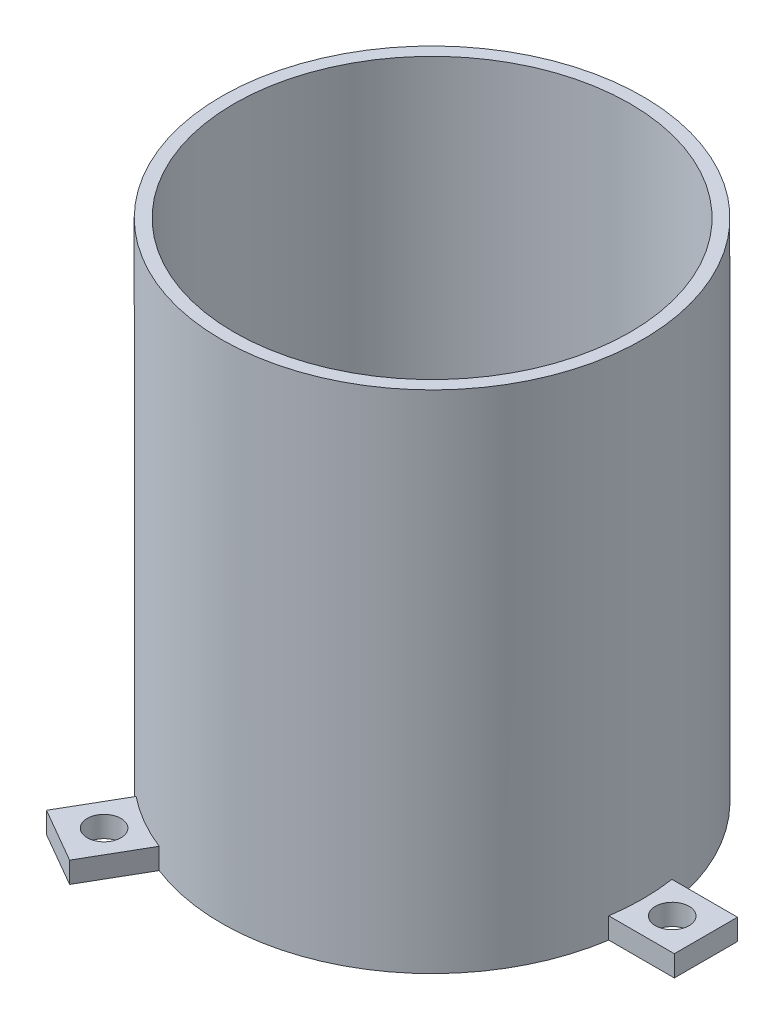
ISO-10303-21;
HEADER;
FILE_DESCRIPTION(('STEP AP214'),'2;1');
FILE_NAME('part.step','',(''),(''),'','','');
FILE_SCHEMA(('AUTOMOTIVE_DESIGN { 1 0 10303 214 1 1 1 1 }'));
ENDSEC;
DATA;
#1=APPLICATION_CONTEXT('core data for automotive mechanical design processes');
#2=APPLICATION_PROTOCOL_DEFINITION('international standard','automotive_design',2000,#1);
#3=PRODUCT_CONTEXT('',#1,'mechanical');
#4=PRODUCT('Part','Part','',(#3));
#5=PRODUCT_RELATED_PRODUCT_CATEGORY('part','',(#4));
#6=PRODUCT_DEFINITION_FORMATION('','',#4);
#7=PRODUCT_DEFINITION_CONTEXT('part definition',#1,'design');
#8=PRODUCT_DEFINITION('design','',#6,#7);
#9=PRODUCT_DEFINITION_SHAPE('','',#8);
#10=(LENGTH_UNIT() NAMED_UNIT(*) SI_UNIT(.MILLI.,.METRE.));
#11=(NAMED_UNIT(*) PLANE_ANGLE_UNIT() SI_UNIT($,.RADIAN.));
#12=(NAMED_UNIT(*) SI_UNIT($,.STERADIAN.) SOLID_ANGLE_UNIT());
#13=UNCERTAINTY_MEASURE_WITH_UNIT(LENGTH_MEASURE(1.E-05),#10,'distance_accuracy_value','');
#14=(GEOMETRIC_REPRESENTATION_CONTEXT(3) GLOBAL_UNCERTAINTY_ASSIGNED_CONTEXT((#13)) GLOBAL_UNIT_ASSIGNED_CONTEXT((#10,
#11,#12)) REPRESENTATION_CONTEXT('',''));
#15=CARTESIAN_POINT('',(0.,0.,0.));
#16=DIRECTION('',(0.,0.,1.));
#17=DIRECTION('',(1.,0.,0.));
#18=AXIS2_PLACEMENT_3D('',#15,#16,#17);
#19=CARTESIAN_POINT('',(0.,120.,0.));
#20=DIRECTION('',(0.,-1.,0.));
#21=DIRECTION('',(0.,0.,-1.));
#22=AXIS2_PLACEMENT_3D('',#19,#20,#21);
#23=CYLINDRICAL_SURFACE('',#22,50.);
#24=CARTESIAN_POINT('',(0.,0.,0.));
#25=DIRECTION('',(0.,1.,0.));
#26=DIRECTION('',(0.,0.,1.));
#27=AXIS2_PLACEMENT_3D('',#24,#25,#26);
#28=CIRCLE('',#27,50.);
#29=CARTESIAN_POINT('',(-31.21234044499,0.,-39.0613594738591));
#30=VERTEX_POINT('',#29);
#31=CARTESIAN_POINT('',(-31.2123404449894,0.,39.0613594738596));
#32=VERTEX_POINT('',#31);
#33=EDGE_CURVE('E36',#30,#32,#28,.T.);
#34=ORIENTED_EDGE('',*,*,#33,.T.);
#35=DIRECTION('',(0.,-1.,0.));
#36=VECTOR('',#35,1.);
#37=CARTESIAN_POINT('',(-31.2123404449894,5.,39.0613594738596));
#38=LINE('',#37,#36);
#39=CARTESIAN_POINT('',(-31.2123404449894,5.,39.0613594738596));
#40=VERTEX_POINT('',#39);
#41=EDGE_CURVE('E47',#40,#32,#38,.T.);
#42=ORIENTED_EDGE('',*,*,#41,.F.);
#43=CARTESIAN_POINT('',(0.,5.,0.));
#44=DIRECTION('',(0.,1.,0.));
#45=DIRECTION('',(0.,0.,-1.));
#46=AXIS2_PLACEMENT_3D('',#43,#44,#45);
#47=CIRCLE('',#46,50.);
#48=CARTESIAN_POINT('',(-18.2219593882228,5.,46.5613594738594));
#49=VERTEX_POINT('',#48);
#50=EDGE_CURVE('E51',#40,#49,#47,.T.);
#51=ORIENTED_EDGE('',*,*,#50,.T.);
#52=DIRECTION('',(0.,-1.,0.));
#53=VECTOR('',#52,1.);
#54=CARTESIAN_POINT('',(-18.2219593882228,5.,46.5613594738594));
#55=LINE('',#54,#53);
#56=CARTESIAN_POINT('',(-18.2219593882228,0.,46.5613594738594));
#57=VERTEX_POINT('',#56);
#58=EDGE_CURVE('E132',#49,#57,#55,.T.);
#59=ORIENTED_EDGE('',*,*,#58,.T.);
#60=CARTESIAN_POINT('',(49.434299833213,0.,7.5));
#61=VERTEX_POINT('',#60);
#62=EDGE_CURVE('E237',#57,#61,#28,.T.);
#63=ORIENTED_EDGE('',*,*,#62,.T.);
#64=DIRECTION('',(0.,-1.,0.));
#65=VECTOR('',#64,1.);
#66=CARTESIAN_POINT('',(49.434299833213,5.,7.5));
#67=LINE('',#66,#65);
#68=CARTESIAN_POINT('',(49.434299833213,5.,7.5));
#69=VERTEX_POINT('',#68);
#70=EDGE_CURVE('E184',#69,#61,#67,.T.);
#71=ORIENTED_EDGE('',*,*,#70,.F.);
#72=CARTESIAN_POINT('',(0.,5.,0.));
#73=DIRECTION('',(0.,1.,0.));
#74=DIRECTION('',(0.,0.,-1.));
#75=AXIS2_PLACEMENT_3D('',#72,#73,#74);
#76=CIRCLE('',#75,50.);
#77=CARTESIAN_POINT('',(49.434299833213,5.,-7.5));
#78=VERTEX_POINT('',#77);
#79=EDGE_CURVE('E164',#69,#78,#76,.T.);
#80=ORIENTED_EDGE('',*,*,#79,.T.);
#81=DIRECTION('',(0.,-1.,0.));
#82=VECTOR('',#81,1.);
#83=CARTESIAN_POINT('',(49.434299833213,5.,-7.5));
#84=LINE('',#83,#82);
#85=CARTESIAN_POINT('',(49.434299833213,0.,-7.5));
#86=VERTEX_POINT('',#85);
#87=EDGE_CURVE('E176',#78,#86,#84,.T.);
#88=ORIENTED_EDGE('',*,*,#87,.T.);
#89=CARTESIAN_POINT('',(-18.2219593882234,0.,-46.5613594738592));
#90=VERTEX_POINT('',#89);
#91=EDGE_CURVE('E234',#86,#90,#28,.T.);
#92=ORIENTED_EDGE('',*,*,#91,.T.);
#93=DIRECTION('',(0.,-1.,0.));
#94=VECTOR('',#93,1.);
#95=CARTESIAN_POINT('',(-18.2219593882234,5.,-46.5613594738592));
#96=LINE('',#95,#94);
#97=CARTESIAN_POINT('',(-18.2219593882234,5.,-46.5613594738592));
#98=VERTEX_POINT('',#97);
#99=EDGE_CURVE('E220',#98,#90,#96,.T.);
#100=ORIENTED_EDGE('',*,*,#99,.F.);
#101=CARTESIAN_POINT('',(0.,5.,0.));
#102=DIRECTION('',(0.,1.,0.));
#103=DIRECTION('',(0.,0.,-1.));
#104=AXIS2_PLACEMENT_3D('',#101,#102,#103);
#105=CIRCLE('',#104,50.);
#106=CARTESIAN_POINT('',(-31.21234044499,5.,-39.0613594738591));
#107=VERTEX_POINT('',#106);
#108=EDGE_CURVE('E200',#98,#107,#105,.T.);
#109=ORIENTED_EDGE('',*,*,#108,.T.);
#110=DIRECTION('',(0.,-1.,0.));
#111=VECTOR('',#110,1.);
#112=CARTESIAN_POINT('',(-31.21234044499,5.,-39.0613594738591));
#113=LINE('',#112,#111);
#114=EDGE_CURVE('E212',#107,#30,#113,.T.);
#115=ORIENTED_EDGE('',*,*,#114,.T.);
#116=EDGE_LOOP('',(#34,#42,#51,#59,#63,#71,#80,#88,#92,#100,#109,#115));
#117=FACE_BOUND('',#116,.T.);
#118=CARTESIAN_POINT('',(0.,120.,0.));
#119=DIRECTION('',(0.,1.,0.));
#120=DIRECTION('',(0.,0.,1.));
#121=AXIS2_PLACEMENT_3D('',#118,#119,#120);
#122=CIRCLE('',#121,50.);
#123=CARTESIAN_POINT('',(0.,120.,50.));
#124=VERTEX_POINT('',#123);
#125=EDGE_CURVE('E11',#124,#124,#122,.T.);
#126=ORIENTED_EDGE('',*,*,#125,.F.);
#127=EDGE_LOOP('',(#126));
#128=FACE_BOUND('',#127,.T.);
#129=ADVANCED_FACE('F33',(#117,#128),#23,.T.);
#130=CARTESIAN_POINT('',(0.,120.,0.));
#131=DIRECTION('',(0.,1.,0.));
#132=DIRECTION('',(0.,0.,1.));
#133=AXIS2_PLACEMENT_3D('',#130,#131,#132);
#134=PLANE('',#133);
#135=CARTESIAN_POINT('',(0.,120.,0.));
#136=DIRECTION('',(0.,1.,0.));
#137=DIRECTION('',(0.,0.,1.));
#138=AXIS2_PLACEMENT_3D('',#135,#136,#137);
#139=CIRCLE('',#138,47.);
#140=CARTESIAN_POINT('',(0.,120.,47.));
#141=VERTEX_POINT('',#140);
#142=EDGE_CURVE('E232',#141,#141,#139,.T.);
#143=ORIENTED_EDGE('',*,*,#142,.F.);
#144=EDGE_LOOP('',(#143));
#145=FACE_BOUND('',#144,.T.);
#146=ORIENTED_EDGE('',*,*,#125,.T.);
#147=EDGE_LOOP('',(#146));
#148=FACE_BOUND('',#147,.T.);
#149=ADVANCED_FACE('F285',(#145,#148),#134,.T.);
#150=CARTESIAN_POINT('',(0.,0.,0.));
#151=DIRECTION('',(0.,1.,0.));
#152=DIRECTION('',(0.,0.,1.));
#153=AXIS2_PLACEMENT_3D('',#150,#151,#152);
#154=PLANE('',#153);
#155=ORIENTED_EDGE('',*,*,#33,.F.);
#156=DIRECTION('',(-0.500000000000004,0.,-0.866025403784437));
#157=VECTOR('',#156,1.);
#158=CARTESIAN_POINT('',(-38.9951905283835,0.,-52.5416512459883));
#159=LINE('',#158,#157);
#160=CARTESIAN_POINT('',(-38.9951905283835,0.,-52.5416512459883));
#161=VERTEX_POINT('',#160);
#162=EDGE_CURVE('E197',#30,#161,#159,.T.);
#163=ORIENTED_EDGE('',*,*,#162,.T.);
#164=DIRECTION('',(0.866025403784436,0.,-0.500000000000004));
#165=VECTOR('',#164,1.);
#166=CARTESIAN_POINT('',(-26.004809471617,0.,-60.0416512459884));
#167=LINE('',#166,#165);
#168=CARTESIAN_POINT('',(-26.004809471617,0.,-60.0416512459884));
#169=VERTEX_POINT('',#168);
#170=EDGE_CURVE('E215',#161,#169,#167,.T.);
#171=ORIENTED_EDGE('',*,*,#170,.T.);
#172=DIRECTION('',(0.500000000000004,0.,0.866025403784436));
#173=VECTOR('',#172,1.);
#174=CARTESIAN_POINT('',(-18.2219593882234,0.,-46.5613594738592));
#175=LINE('',#174,#173);
#176=EDGE_CURVE('E203',#169,#90,#175,.T.);
#177=ORIENTED_EDGE('',*,*,#176,.T.);
#178=ORIENTED_EDGE('',*,*,#91,.F.);
#179=DIRECTION('',(1.,0.,0.));
#180=VECTOR('',#179,1.);
#181=CARTESIAN_POINT('',(65.,0.,-7.5));
#182=LINE('',#181,#180);
#183=CARTESIAN_POINT('',(65.,0.,-7.5));
#184=VERTEX_POINT('',#183);
#185=EDGE_CURVE('E161',#86,#184,#182,.T.);
#186=ORIENTED_EDGE('',*,*,#185,.T.);
#187=DIRECTION('',(0.,0.,1.));
#188=VECTOR('',#187,1.);
#189=CARTESIAN_POINT('',(65.,0.,7.5));
#190=LINE('',#189,#188);
#191=CARTESIAN_POINT('',(65.,0.,7.5));
#192=VERTEX_POINT('',#191);
#193=EDGE_CURVE('E179',#184,#192,#190,.T.);
#194=ORIENTED_EDGE('',*,*,#193,.T.);
#195=DIRECTION('',(-1.,0.,0.));
#196=VECTOR('',#195,1.);
#197=CARTESIAN_POINT('',(49.434299833213,0.,7.5));
#198=LINE('',#197,#196);
#199=EDGE_CURVE('E167',#192,#61,#198,.T.);
#200=ORIENTED_EDGE('',*,*,#199,.T.);
#201=ORIENTED_EDGE('',*,*,#62,.F.);
#202=DIRECTION('',(-0.499999999999992,0.,0.866025403784443));
#203=VECTOR('',#202,1.);
#204=CARTESIAN_POINT('',(-26.0048094716162,0.,60.0416512459888));
#205=LINE('',#204,#203);
#206=CARTESIAN_POINT('',(-26.0048094716162,0.,60.0416512459888));
#207=VERTEX_POINT('',#206);
#208=EDGE_CURVE('E148',#57,#207,#205,.T.);
#209=ORIENTED_EDGE('',*,*,#208,.T.);
#210=DIRECTION('',(-0.866025403784443,0.,-0.499999999999992));
#211=VECTOR('',#210,1.);
#212=CARTESIAN_POINT('',(-38.9951905283828,0.,52.5416512459889));
#213=LINE('',#212,#211);
#214=CARTESIAN_POINT('',(-38.9951905283828,0.,52.5416512459889));
#215=VERTEX_POINT('',#214);
#216=EDGE_CURVE('E126',#207,#215,#213,.T.);
#217=ORIENTED_EDGE('',*,*,#216,.T.);
#218=DIRECTION('',(0.499999999999992,0.,-0.866025403784443));
#219=VECTOR('',#218,1.);
#220=CARTESIAN_POINT('',(-31.2123404449894,0.,39.0613594738596));
#221=LINE('',#220,#219);
#222=EDGE_CURVE('E143',#215,#32,#221,.T.);
#223=ORIENTED_EDGE('',*,*,#222,.T.);
#224=EDGE_LOOP('',(#155,#163,#171,#177,#178,#186,#194,#200,#201,#209,#217,#223));
#225=FACE_BOUND('',#224,.T.);
#226=CARTESIAN_POINT('',(-28.5000000000002,0.,-49.3634480157129));
#227=DIRECTION('',(0.,-1.,0.));
#228=DIRECTION('',(0.,0.,-1.));
#229=AXIS2_PLACEMENT_3D('',#226,#227,#228);
#230=CIRCLE('',#229,4.);
#231=CARTESIAN_POINT('',(-28.5000000000002,0.,-53.3634480157129));
#232=VERTEX_POINT('',#231);
#233=EDGE_CURVE('E187',#232,#232,#230,.T.);
#234=ORIENTED_EDGE('',*,*,#233,.F.);
#235=EDGE_LOOP('',(#234));
#236=FACE_BOUND('',#235,.T.);
#237=CARTESIAN_POINT('',(57.,0.,0.));
#238=DIRECTION('',(0.,-1.,0.));
#239=DIRECTION('',(0.,0.,-1.));
#240=AXIS2_PLACEMENT_3D('',#237,#238,#239);
#241=CIRCLE('',#240,4.);
#242=CARTESIAN_POINT('',(57.,0.,-4.));
#243=VERTEX_POINT('',#242);
#244=EDGE_CURVE('E155',#243,#243,#241,.T.);
#245=ORIENTED_EDGE('',*,*,#244,.F.);
#246=EDGE_LOOP('',(#245));
#247=FACE_BOUND('',#246,.T.);
#248=CARTESIAN_POINT('',(-28.4999999999995,0.,49.3634480157133));
#249=DIRECTION('',(0.,-1.,0.));
#250=DIRECTION('',(0.,0.,-1.));
#251=AXIS2_PLACEMENT_3D('',#248,#249,#250);
#252=CIRCLE('',#251,4.);
#253=CARTESIAN_POINT('',(-28.4999999999995,0.,45.3634480157133));
#254=VERTEX_POINT('',#253);
#255=EDGE_CURVE('E443',#254,#254,#252,.T.);
#256=ORIENTED_EDGE('',*,*,#255,.F.);
#257=EDGE_LOOP('',(#256));
#258=FACE_BOUND('',#257,.T.);
#259=ADVANCED_FACE('F245',(#225,#236,#247,#258),#154,.F.);
#260=CARTESIAN_POINT('',(0.,120.,0.));
#261=DIRECTION('',(0.,-1.,0.));
#262=DIRECTION('',(0.,0.,-1.));
#263=AXIS2_PLACEMENT_3D('',#260,#261,#262);
#264=CYLINDRICAL_SURFACE('',#263,47.);
#265=ORIENTED_EDGE('',*,*,#142,.T.);
#266=EDGE_LOOP('',(#265));
#267=FACE_BOUND('',#266,.T.);
#268=CARTESIAN_POINT('',(0.,3.,0.));
#269=DIRECTION('',(0.,1.,0.));
#270=DIRECTION('',(0.,0.,1.));
#271=AXIS2_PLACEMENT_3D('',#268,#269,#270);
#272=CIRCLE('',#271,47.);
#273=CARTESIAN_POINT('',(0.,3.,47.));
#274=VERTEX_POINT('',#273);
#275=EDGE_CURVE('E223',#274,#274,#272,.T.);
#276=ORIENTED_EDGE('',*,*,#275,.F.);
#277=EDGE_LOOP('',(#276));
#278=FACE_BOUND('',#277,.T.);
#279=ADVANCED_FACE('F294',(#267,#278),#264,.F.);
#280=CARTESIAN_POINT('',(0.,3.,0.));
#281=DIRECTION('',(0.,1.,0.));
#282=DIRECTION('',(0.,0.,1.));
#283=AXIS2_PLACEMENT_3D('',#280,#281,#282);
#284=PLANE('',#283);
#285=ORIENTED_EDGE('',*,*,#275,.T.);
#286=EDGE_LOOP('',(#285));
#287=FACE_BOUND('',#286,.T.);
#288=ADVANCED_FACE('F282',(#287),#284,.T.);
#289=CARTESIAN_POINT('',(-18.2219593882234,5.,-46.5613594738592));
#290=DIRECTION('',(0.866025403784436,0.,-0.500000000000004));
#291=DIRECTION('',(-0.500000000000004,0.,-0.866025403784436));
#292=AXIS2_PLACEMENT_3D('',#289,#290,#291);
#293=PLANE('',#292);
#294=ORIENTED_EDGE('',*,*,#176,.F.);
#295=DIRECTION('',(0.,-1.,0.));
#296=VECTOR('',#295,1.);
#297=CARTESIAN_POINT('',(-26.004809471617,5.,-60.0416512459884));
#298=LINE('',#297,#296);
#299=CARTESIAN_POINT('',(-26.004809471617,5.,-60.0416512459884));
#300=VERTEX_POINT('',#299);
#301=EDGE_CURVE('E224',#300,#169,#298,.T.);
#302=ORIENTED_EDGE('',*,*,#301,.F.);
#303=DIRECTION('',(0.500000000000004,0.,0.866025403784436));
#304=VECTOR('',#303,1.);
#305=CARTESIAN_POINT('',(-18.2219593882234,5.,-46.5613594738592));
#306=LINE('',#305,#304);
#307=EDGE_CURVE('E209',#300,#98,#306,.T.);
#308=ORIENTED_EDGE('',*,*,#307,.T.);
#309=ORIENTED_EDGE('',*,*,#99,.T.);
#310=EDGE_LOOP('',(#294,#302,#308,#309));
#311=FACE_BOUND('',#310,.T.);
#312=ADVANCED_FACE('F264',(#311),#293,.T.);
#313=CARTESIAN_POINT('',(-26.004809471617,5.,-60.0416512459884));
#314=DIRECTION('',(-0.500000000000004,0.,-0.866025403784436));
#315=DIRECTION('',(-0.866025403784436,0.,0.500000000000004));
#316=AXIS2_PLACEMENT_3D('',#313,#314,#315);
#317=PLANE('',#316);
#318=ORIENTED_EDGE('',*,*,#170,.F.);
#319=DIRECTION('',(0.,-1.,0.));
#320=VECTOR('',#319,1.);
#321=CARTESIAN_POINT('',(-38.9951905283835,5.,-52.5416512459883));
#322=LINE('',#321,#320);
#323=CARTESIAN_POINT('',(-38.9951905283835,5.,-52.5416512459883));
#324=VERTEX_POINT('',#323);
#325=EDGE_CURVE('E226',#324,#161,#322,.T.);
#326=ORIENTED_EDGE('',*,*,#325,.F.);
#327=DIRECTION('',(0.866025403784436,0.,-0.500000000000004));
#328=VECTOR('',#327,1.);
#329=CARTESIAN_POINT('',(-26.004809471617,5.,-60.0416512459884));
#330=LINE('',#329,#328);
#331=EDGE_CURVE('E206',#324,#300,#330,.T.);
#332=ORIENTED_EDGE('',*,*,#331,.T.);
#333=ORIENTED_EDGE('',*,*,#301,.T.);
#334=EDGE_LOOP('',(#318,#326,#332,#333));
#335=FACE_BOUND('',#334,.T.);
#336=ADVANCED_FACE('F274',(#335),#317,.T.);
#337=CARTESIAN_POINT('',(-38.9951905283835,5.,-52.5416512459883));
#338=DIRECTION('',(-0.866025403784437,0.,0.500000000000004));
#339=DIRECTION('',(0.500000000000004,0.,0.866025403784437));
#340=AXIS2_PLACEMENT_3D('',#337,#338,#339);
#341=PLANE('',#340);
#342=ORIENTED_EDGE('',*,*,#162,.F.);
#343=ORIENTED_EDGE('',*,*,#114,.F.);
#344=DIRECTION('',(-0.500000000000004,0.,-0.866025403784437));
#345=VECTOR('',#344,1.);
#346=CARTESIAN_POINT('',(-38.9951905283835,5.,-52.5416512459883));
#347=LINE('',#346,#345);
#348=EDGE_CURVE('E202',#107,#324,#347,.T.);
#349=ORIENTED_EDGE('',*,*,#348,.T.);
#350=ORIENTED_EDGE('',*,*,#325,.T.);
#351=EDGE_LOOP('',(#342,#343,#349,#350));
#352=FACE_BOUND('',#351,.T.);
#353=ADVANCED_FACE('F272',(#352),#341,.T.);
#354=CARTESIAN_POINT('',(0.,5.,0.));
#355=DIRECTION('',(0.,-1.,0.));
#356=DIRECTION('',(0.,0.,-1.));
#357=AXIS2_PLACEMENT_3D('',#354,#355,#356);
#358=PLANE('',#357);
#359=CARTESIAN_POINT('',(-28.5000000000002,5.,-49.3634480157129));
#360=DIRECTION('',(0.,-1.,0.));
#361=DIRECTION('',(0.,0.,-1.));
#362=AXIS2_PLACEMENT_3D('',#359,#360,#361);
#363=CIRCLE('',#362,4.);
#364=CARTESIAN_POINT('',(-28.5000000000002,5.,-53.3634480157129));
#365=VERTEX_POINT('',#364);
#366=EDGE_CURVE('E194',#365,#365,#363,.T.);
#367=ORIENTED_EDGE('',*,*,#366,.T.);
#368=EDGE_LOOP('',(#367));
#369=FACE_BOUND('',#368,.T.);
#370=ORIENTED_EDGE('',*,*,#108,.F.);
#371=ORIENTED_EDGE('',*,*,#307,.F.);
#372=ORIENTED_EDGE('',*,*,#331,.F.);
#373=ORIENTED_EDGE('',*,*,#348,.F.);
#374=EDGE_LOOP('',(#370,#371,#372,#373));
#375=FACE_BOUND('',#374,.T.);
#376=ADVANCED_FACE('F269',(#369,#375),#358,.F.);
#377=CARTESIAN_POINT('',(-28.5000000000002,5.,-49.3634480157129));
#378=DIRECTION('',(0.,-1.,0.));
#379=DIRECTION('',(0.,0.,-1.));
#380=AXIS2_PLACEMENT_3D('',#377,#378,#379);
#381=CYLINDRICAL_SURFACE('',#380,4.);
#382=ORIENTED_EDGE('',*,*,#366,.F.);
#383=EDGE_LOOP('',(#382));
#384=FACE_BOUND('',#383,.T.);
#385=ORIENTED_EDGE('',*,*,#233,.T.);
#386=EDGE_LOOP('',(#385));
#387=FACE_BOUND('',#386,.T.);
#388=ADVANCED_FACE('F336',(#384,#387),#381,.F.);
#389=CARTESIAN_POINT('',(49.434299833213,5.,7.5));
#390=DIRECTION('',(0.,0.,1.));
#391=DIRECTION('',(1.,0.,0.));
#392=AXIS2_PLACEMENT_3D('',#389,#390,#391);
#393=PLANE('',#392);
#394=ORIENTED_EDGE('',*,*,#199,.F.);
#395=DIRECTION('',(0.,-1.,0.));
#396=VECTOR('',#395,1.);
#397=CARTESIAN_POINT('',(65.,5.,7.5));
#398=LINE('',#397,#396);
#399=CARTESIAN_POINT('',(65.,5.,7.5));
#400=VERTEX_POINT('',#399);
#401=EDGE_CURVE('E188',#400,#192,#398,.T.);
#402=ORIENTED_EDGE('',*,*,#401,.F.);
#403=DIRECTION('',(-1.,0.,0.));
#404=VECTOR('',#403,1.);
#405=CARTESIAN_POINT('',(49.434299833213,5.,7.5));
#406=LINE('',#405,#404);
#407=EDGE_CURVE('E173',#400,#69,#406,.T.);
#408=ORIENTED_EDGE('',*,*,#407,.T.);
#409=ORIENTED_EDGE('',*,*,#70,.T.);
#410=EDGE_LOOP('',(#394,#402,#408,#409));
#411=FACE_BOUND('',#410,.T.);
#412=ADVANCED_FACE('F250',(#411),#393,.T.);
#413=CARTESIAN_POINT('',(65.,5.,7.5));
#414=DIRECTION('',(1.,0.,0.));
#415=DIRECTION('',(0.,0.,-1.));
#416=AXIS2_PLACEMENT_3D('',#413,#414,#415);
#417=PLANE('',#416);
#418=ORIENTED_EDGE('',*,*,#193,.F.);
#419=DIRECTION('',(0.,-1.,0.));
#420=VECTOR('',#419,1.);
#421=CARTESIAN_POINT('',(65.,5.,-7.5));
#422=LINE('',#421,#420);
#423=CARTESIAN_POINT('',(65.,5.,-7.5));
#424=VERTEX_POINT('',#423);
#425=EDGE_CURVE('E190',#424,#184,#422,.T.);
#426=ORIENTED_EDGE('',*,*,#425,.F.);
#427=DIRECTION('',(0.,0.,1.));
#428=VECTOR('',#427,1.);
#429=CARTESIAN_POINT('',(65.,5.,7.5));
#430=LINE('',#429,#428);
#431=EDGE_CURVE('E170',#424,#400,#430,.T.);
#432=ORIENTED_EDGE('',*,*,#431,.T.);
#433=ORIENTED_EDGE('',*,*,#401,.T.);
#434=EDGE_LOOP('',(#418,#426,#432,#433));
#435=FACE_BOUND('',#434,.T.);
#436=ADVANCED_FACE('F355',(#435),#417,.T.);
#437=CARTESIAN_POINT('',(65.,5.,-7.5));
#438=DIRECTION('',(0.,0.,-1.));
#439=DIRECTION('',(-1.,0.,0.));
#440=AXIS2_PLACEMENT_3D('',#437,#438,#439);
#441=PLANE('',#440);
#442=ORIENTED_EDGE('',*,*,#185,.F.);
#443=ORIENTED_EDGE('',*,*,#87,.F.);
#444=DIRECTION('',(1.,0.,0.));
#445=VECTOR('',#444,1.);
#446=CARTESIAN_POINT('',(65.,5.,-7.5));
#447=LINE('',#446,#445);
#448=EDGE_CURVE('E166',#78,#424,#447,.T.);
#449=ORIENTED_EDGE('',*,*,#448,.T.);
#450=ORIENTED_EDGE('',*,*,#425,.T.);
#451=EDGE_LOOP('',(#442,#443,#449,#450));
#452=FACE_BOUND('',#451,.T.);
#453=ADVANCED_FACE('F259',(#452),#441,.T.);
#454=CARTESIAN_POINT('',(0.,5.,0.));
#455=DIRECTION('',(0.,-1.,0.));
#456=DIRECTION('',(0.,0.,-1.));
#457=AXIS2_PLACEMENT_3D('',#454,#455,#456);
#458=PLANE('',#457);
#459=CARTESIAN_POINT('',(57.,5.,0.));
#460=DIRECTION('',(0.,-1.,0.));
#461=DIRECTION('',(0.,0.,-1.));
#462=AXIS2_PLACEMENT_3D('',#459,#460,#461);
#463=CIRCLE('',#462,4.);
#464=CARTESIAN_POINT('',(57.,5.,-4.));
#465=VERTEX_POINT('',#464);
#466=EDGE_CURVE('E158',#465,#465,#463,.T.);
#467=ORIENTED_EDGE('',*,*,#466,.T.);
#468=EDGE_LOOP('',(#467));
#469=FACE_BOUND('',#468,.T.);
#470=ORIENTED_EDGE('',*,*,#79,.F.);
#471=ORIENTED_EDGE('',*,*,#407,.F.);
#472=ORIENTED_EDGE('',*,*,#431,.F.);
#473=ORIENTED_EDGE('',*,*,#448,.F.);
#474=EDGE_LOOP('',(#470,#471,#472,#473));
#475=FACE_BOUND('',#474,.T.);
#476=ADVANCED_FACE('F254',(#469,#475),#458,.F.);
#477=CARTESIAN_POINT('',(57.,5.,0.));
#478=DIRECTION('',(0.,-1.,0.));
#479=DIRECTION('',(0.,0.,-1.));
#480=AXIS2_PLACEMENT_3D('',#477,#478,#479);
#481=CYLINDRICAL_SURFACE('',#480,4.);
#482=ORIENTED_EDGE('',*,*,#466,.F.);
#483=EDGE_LOOP('',(#482));
#484=FACE_BOUND('',#483,.T.);
#485=ORIENTED_EDGE('',*,*,#244,.T.);
#486=EDGE_LOOP('',(#485));
#487=FACE_BOUND('',#486,.T.);
#488=ADVANCED_FACE('F381',(#484,#487),#481,.F.);
#489=CARTESIAN_POINT('',(-31.2123404449894,5.,39.0613594738596));
#490=DIRECTION('',(-0.866025403784443,0.,-0.499999999999992));
#491=DIRECTION('',(-0.499999999999992,0.,0.866025403784443));
#492=AXIS2_PLACEMENT_3D('',#489,#490,#491);
#493=PLANE('',#492);
#494=ORIENTED_EDGE('',*,*,#222,.F.);
#495=DIRECTION('',(0.,-1.,0.));
#496=VECTOR('',#495,1.);
#497=CARTESIAN_POINT('',(-38.9951905283828,5.,52.5416512459889));
#498=LINE('',#497,#496);
#499=CARTESIAN_POINT('',(-38.9951905283828,5.,52.5416512459889));
#500=VERTEX_POINT('',#499);
#501=EDGE_CURVE('E131',#500,#215,#498,.T.);
#502=ORIENTED_EDGE('',*,*,#501,.F.);
#503=DIRECTION('',(0.499999999999992,0.,-0.866025403784443));
#504=VECTOR('',#503,1.);
#505=CARTESIAN_POINT('',(-31.2123404449894,5.,39.0613594738596));
#506=LINE('',#505,#504);
#507=EDGE_CURVE('E139',#500,#40,#506,.T.);
#508=ORIENTED_EDGE('',*,*,#507,.T.);
#509=ORIENTED_EDGE('',*,*,#41,.T.);
#510=EDGE_LOOP('',(#494,#502,#508,#509));
#511=FACE_BOUND('',#510,.T.);
#512=ADVANCED_FACE('F244',(#511),#493,.T.);
#513=CARTESIAN_POINT('',(-38.9951905283828,5.,52.5416512459889));
#514=DIRECTION('',(-0.499999999999992,0.,0.866025403784443));
#515=DIRECTION('',(0.866025403784443,0.,0.499999999999992));
#516=AXIS2_PLACEMENT_3D('',#513,#514,#515);
#517=PLANE('',#516);
#518=ORIENTED_EDGE('',*,*,#216,.F.);
#519=DIRECTION('',(0.,-1.,0.));
#520=VECTOR('',#519,1.);
#521=CARTESIAN_POINT('',(-26.0048094716162,5.,60.0416512459888));
#522=LINE('',#521,#520);
#523=CARTESIAN_POINT('',(-26.0048094716162,5.,60.0416512459888));
#524=VERTEX_POINT('',#523);
#525=EDGE_CURVE('E120',#524,#207,#522,.T.);
#526=ORIENTED_EDGE('',*,*,#525,.F.);
#527=DIRECTION('',(-0.866025403784443,0.,-0.499999999999992));
#528=VECTOR('',#527,1.);
#529=CARTESIAN_POINT('',(-38.9951905283828,5.,52.5416512459889));
#530=LINE('',#529,#528);
#531=EDGE_CURVE('E123',#524,#500,#530,.T.);
#532=ORIENTED_EDGE('',*,*,#531,.T.);
#533=ORIENTED_EDGE('',*,*,#501,.T.);
#534=EDGE_LOOP('',(#518,#526,#532,#533));
#535=FACE_BOUND('',#534,.T.);
#536=ADVANCED_FACE('F122',(#535),#517,.T.);
#537=CARTESIAN_POINT('',(-26.0048094716162,5.,60.0416512459888));
#538=DIRECTION('',(0.866025403784443,0.,0.499999999999992));
#539=DIRECTION('',(0.499999999999992,0.,-0.866025403784443));
#540=AXIS2_PLACEMENT_3D('',#537,#538,#539);
#541=PLANE('',#540);
#542=ORIENTED_EDGE('',*,*,#208,.F.);
#543=ORIENTED_EDGE('',*,*,#58,.F.);
#544=DIRECTION('',(-0.499999999999992,0.,0.866025403784443));
#545=VECTOR('',#544,1.);
#546=CARTESIAN_POINT('',(-26.0048094716162,5.,60.0416512459888));
#547=LINE('',#546,#545);
#548=EDGE_CURVE('E137',#49,#524,#547,.T.);
#549=ORIENTED_EDGE('',*,*,#548,.T.);
#550=ORIENTED_EDGE('',*,*,#525,.T.);
#551=EDGE_LOOP('',(#542,#543,#549,#550));
#552=FACE_BOUND('',#551,.T.);
#553=ADVANCED_FACE('F141',(#552),#541,.T.);
#554=CARTESIAN_POINT('',(0.,5.,0.));
#555=DIRECTION('',(0.,-1.,0.));
#556=DIRECTION('',(0.,0.,-1.));
#557=AXIS2_PLACEMENT_3D('',#554,#555,#556);
#558=PLANE('',#557);
#559=CARTESIAN_POINT('',(-28.4999999999995,5.,49.3634480157133));
#560=DIRECTION('',(0.,-1.,0.));
#561=DIRECTION('',(0.,0.,-1.));
#562=AXIS2_PLACEMENT_3D('',#559,#560,#561);
#563=CIRCLE('',#562,4.);
#564=CARTESIAN_POINT('',(-28.4999999999995,5.,45.3634480157133));
#565=VERTEX_POINT('',#564);
#566=EDGE_CURVE('E150',#565,#565,#563,.T.);
#567=ORIENTED_EDGE('',*,*,#566,.T.);
#568=EDGE_LOOP('',(#567));
#569=FACE_BOUND('',#568,.T.);
#570=ORIENTED_EDGE('',*,*,#50,.F.);
#571=ORIENTED_EDGE('',*,*,#507,.F.);
#572=ORIENTED_EDGE('',*,*,#531,.F.);
#573=ORIENTED_EDGE('',*,*,#548,.F.);
#574=EDGE_LOOP('',(#570,#571,#572,#573));
#575=FACE_BOUND('',#574,.T.);
#576=ADVANCED_FACE('F136',(#569,#575),#558,.F.);
#577=CARTESIAN_POINT('',(-28.4999999999995,5.,49.3634480157133));
#578=DIRECTION('',(0.,-1.,0.));
#579=DIRECTION('',(0.,0.,-1.));
#580=AXIS2_PLACEMENT_3D('',#577,#578,#579);
#581=CYLINDRICAL_SURFACE('',#580,4.);
#582=ORIENTED_EDGE('',*,*,#566,.F.);
#583=EDGE_LOOP('',(#582));
#584=FACE_BOUND('',#583,.T.);
#585=ORIENTED_EDGE('',*,*,#255,.T.);
#586=EDGE_LOOP('',(#585));
#587=FACE_BOUND('',#586,.T.);
#588=ADVANCED_FACE('F424',(#584,#587),#581,.F.);
#589=CLOSED_SHELL('',(#129,#149,#259,#279,#288,#312,#336,#353,#376,#388,#412,#436,#453,#476,
#488,#512,#536,#553,#576,#588));
#590=MANIFOLD_SOLID_BREP('B2',#589);
#591=ADVANCED_BREP_SHAPE_REPRESENTATION('',(#18,#590),#14);
#592=SHAPE_DEFINITION_REPRESENTATION(#9,#591);
ENDSEC;
END-ISO-10303-21;
